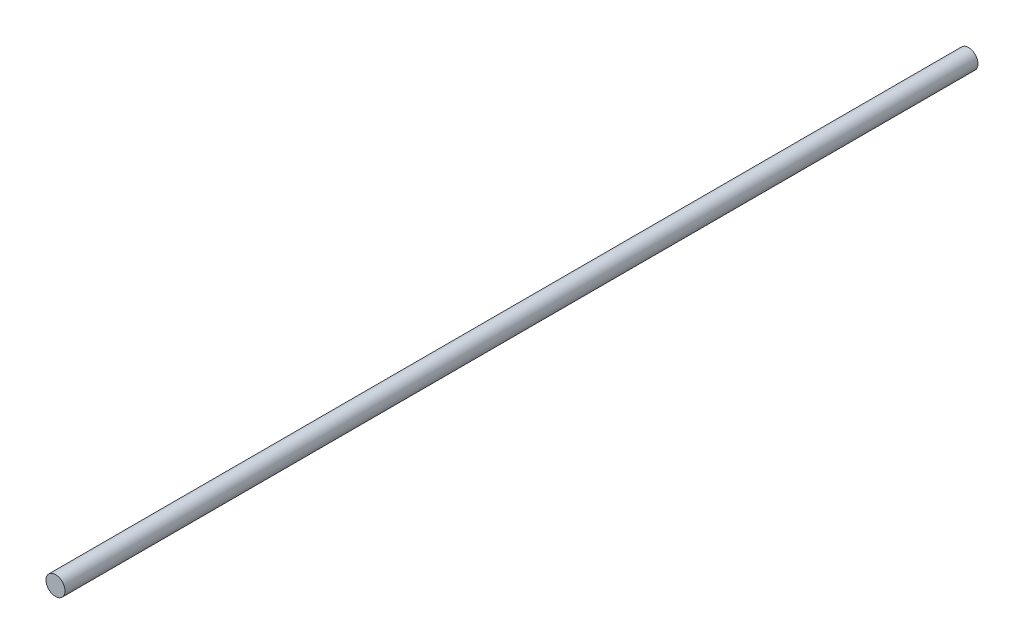
ISO-10303-21;
HEADER;
FILE_DESCRIPTION(('STEP AP214'),'2;1');
FILE_NAME('part.step','',(''),(''),'','','');
FILE_SCHEMA(('AUTOMOTIVE_DESIGN { 1 0 10303 214 1 1 1 1 }'));
ENDSEC;
DATA;
#1=APPLICATION_CONTEXT('core data for automotive mechanical design processes');
#2=APPLICATION_PROTOCOL_DEFINITION('international standard','automotive_design',2000,#1);
#3=PRODUCT_CONTEXT('',#1,'mechanical');
#4=PRODUCT('Part','Part','',(#3));
#5=PRODUCT_RELATED_PRODUCT_CATEGORY('part','',(#4));
#6=PRODUCT_DEFINITION_FORMATION('','',#4);
#7=PRODUCT_DEFINITION_CONTEXT('part definition',#1,'design');
#8=PRODUCT_DEFINITION('design','',#6,#7);
#9=PRODUCT_DEFINITION_SHAPE('','',#8);
#10=(LENGTH_UNIT() NAMED_UNIT(*) SI_UNIT(.MILLI.,.METRE.));
#11=(NAMED_UNIT(*) PLANE_ANGLE_UNIT() SI_UNIT($,.RADIAN.));
#12=(NAMED_UNIT(*) SI_UNIT($,.STERADIAN.) SOLID_ANGLE_UNIT());
#13=UNCERTAINTY_MEASURE_WITH_UNIT(LENGTH_MEASURE(1.E-05),#10,'distance_accuracy_value','');
#14=(GEOMETRIC_REPRESENTATION_CONTEXT(3) GLOBAL_UNCERTAINTY_ASSIGNED_CONTEXT((#13)) GLOBAL_UNIT_ASSIGNED_CONTEXT((#10,
#11,#12)) REPRESENTATION_CONTEXT('',''));
#15=CARTESIAN_POINT('',(0.,0.,0.));
#16=DIRECTION('',(0.,0.,1.));
#17=DIRECTION('',(1.,0.,0.));
#18=AXIS2_PLACEMENT_3D('',#15,#16,#17);
#19=CARTESIAN_POINT('',(0.,0.,304.8));
#20=DIRECTION('',(0.,0.,-1.));
#21=DIRECTION('',(-1.,0.,0.));
#22=AXIS2_PLACEMENT_3D('',#19,#20,#21);
#23=CYLINDRICAL_SURFACE('',#22,3.175);
#24=CARTESIAN_POINT('',(0.,0.,304.8));
#25=DIRECTION('',(0.,0.,1.));
#26=DIRECTION('',(1.,0.,0.));
#27=AXIS2_PLACEMENT_3D('',#24,#25,#26);
#28=CIRCLE('',#27,3.175);
#29=CARTESIAN_POINT('',(3.175,0.,304.8));
#30=VERTEX_POINT('',#29);
#31=EDGE_CURVE('E10',#30,#30,#28,.T.);
#32=ORIENTED_EDGE('',*,*,#31,.F.);
#33=EDGE_LOOP('',(#32));
#34=FACE_BOUND('',#33,.T.);
#35=CARTESIAN_POINT('',(0.,0.,0.));
#36=DIRECTION('',(0.,0.,1.));
#37=DIRECTION('',(1.,0.,0.));
#38=AXIS2_PLACEMENT_3D('',#35,#36,#37);
#39=CIRCLE('',#38,3.175);
#40=CARTESIAN_POINT('',(3.175,0.,0.));
#41=VERTEX_POINT('',#40);
#42=EDGE_CURVE('E44',#41,#41,#39,.T.);
#43=ORIENTED_EDGE('',*,*,#42,.T.);
#44=EDGE_LOOP('',(#43));
#45=FACE_BOUND('',#44,.T.);
#46=ADVANCED_FACE('F41',(#34,#45),#23,.T.);
#47=CARTESIAN_POINT('',(0.,0.,304.8));
#48=DIRECTION('',(0.,0.,1.));
#49=DIRECTION('',(1.,0.,0.));
#50=AXIS2_PLACEMENT_3D('',#47,#48,#49);
#51=PLANE('',#50);
#52=ORIENTED_EDGE('',*,*,#31,.T.);
#53=EDGE_LOOP('',(#52));
#54=FACE_BOUND('',#53,.T.);
#55=ADVANCED_FACE('F58',(#54),#51,.T.);
#56=CARTESIAN_POINT('',(0.,0.,0.));
#57=DIRECTION('',(0.,0.,1.));
#58=DIRECTION('',(1.,0.,0.));
#59=AXIS2_PLACEMENT_3D('',#56,#57,#58);
#60=PLANE('',#59);
#61=ORIENTED_EDGE('',*,*,#42,.F.);
#62=EDGE_LOOP('',(#61));
#63=FACE_BOUND('',#62,.T.);
#64=ADVANCED_FACE('F56',(#63),#60,.F.);
#65=CLOSED_SHELL('',(#46,#55,#64));
#66=MANIFOLD_SOLID_BREP('B2',#65);
#67=ADVANCED_BREP_SHAPE_REPRESENTATION('',(#18,#66),#14);
#68=SHAPE_DEFINITION_REPRESENTATION(#9,#67);
ENDSEC;
END-ISO-10303-21;
